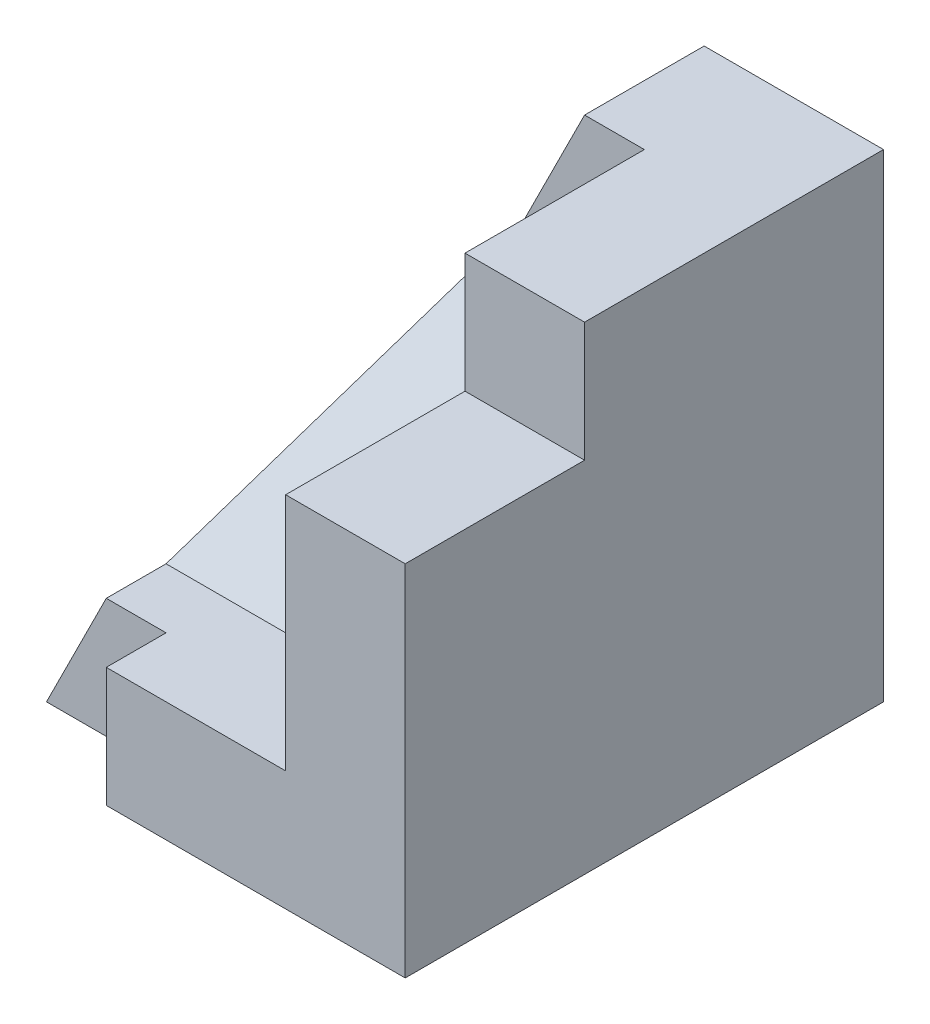
ISO-10303-21;
HEADER;
FILE_DESCRIPTION(('STEP AP214'),'2;1');
FILE_NAME('part.step','',(''),(''),'','','');
FILE_SCHEMA(('AUTOMOTIVE_DESIGN { 1 0 10303 214 1 1 1 1 }'));
ENDSEC;
DATA;
#1=APPLICATION_CONTEXT('core data for automotive mechanical design processes');
#2=APPLICATION_PROTOCOL_DEFINITION('international standard','automotive_design',2000,#1);
#3=PRODUCT_CONTEXT('',#1,'mechanical');
#4=PRODUCT('Part','Part','',(#3));
#5=PRODUCT_RELATED_PRODUCT_CATEGORY('part','',(#4));
#6=PRODUCT_DEFINITION_FORMATION('','',#4);
#7=PRODUCT_DEFINITION_CONTEXT('part definition',#1,'design');
#8=PRODUCT_DEFINITION('design','',#6,#7);
#9=PRODUCT_DEFINITION_SHAPE('','',#8);
#10=(LENGTH_UNIT() NAMED_UNIT(*) SI_UNIT(.MILLI.,.METRE.));
#11=(NAMED_UNIT(*) PLANE_ANGLE_UNIT() SI_UNIT($,.RADIAN.));
#12=(NAMED_UNIT(*) SI_UNIT($,.STERADIAN.) SOLID_ANGLE_UNIT());
#13=UNCERTAINTY_MEASURE_WITH_UNIT(LENGTH_MEASURE(1.E-05),#10,'distance_accuracy_value','');
#14=(GEOMETRIC_REPRESENTATION_CONTEXT(3) GLOBAL_UNCERTAINTY_ASSIGNED_CONTEXT((#13)) GLOBAL_UNIT_ASSIGNED_CONTEXT((#10,
#11,#12)) REPRESENTATION_CONTEXT('',''));
#15=CARTESIAN_POINT('',(0.,0.,0.));
#16=DIRECTION('',(0.,0.,1.));
#17=DIRECTION('',(1.,0.,0.));
#18=AXIS2_PLACEMENT_3D('',#15,#16,#17);
#19=CARTESIAN_POINT('',(17.5,10.,25.));
#20=DIRECTION('',(0.,-1.,0.));
#21=DIRECTION('',(1.,0.,0.));
#22=AXIS2_PLACEMENT_3D('',#19,#20,#21);
#23=PLANE('',#22);
#24=DIRECTION('',(1.,0.,0.));
#25=VECTOR('',#24,1.);
#26=CARTESIAN_POINT('',(17.5,10.,25.));
#27=LINE('',#26,#25);
#28=CARTESIAN_POINT('',(7.5,10.,25.));
#29=VERTEX_POINT('',#28);
#30=CARTESIAN_POINT('',(17.5,10.,25.));
#31=VERTEX_POINT('',#30);
#32=EDGE_CURVE('E197',#29,#31,#27,.T.);
#33=ORIENTED_EDGE('',*,*,#32,.F.);
#34=DIRECTION('',(0.,0.,1.));
#35=VECTOR('',#34,1.);
#36=CARTESIAN_POINT('',(7.5,10.,25.));
#37=LINE('',#36,#35);
#38=CARTESIAN_POINT('',(7.5,10.,40.));
#39=VERTEX_POINT('',#38);
#40=EDGE_CURVE('E200',#29,#39,#37,.T.);
#41=ORIENTED_EDGE('',*,*,#40,.T.);
#42=DIRECTION('',(1.,0.,0.));
#43=VECTOR('',#42,1.);
#44=CARTESIAN_POINT('',(17.5,10.,40.));
#45=LINE('',#44,#43);
#46=CARTESIAN_POINT('',(17.5,10.,40.));
#47=VERTEX_POINT('',#46);
#48=EDGE_CURVE('E190',#39,#47,#45,.T.);
#49=ORIENTED_EDGE('',*,*,#48,.T.);
#50=DIRECTION('',(0.,0.,1.));
#51=VECTOR('',#50,1.);
#52=CARTESIAN_POINT('',(17.5,10.,25.));
#53=LINE('',#52,#51);
#54=EDGE_CURVE('E203',#31,#47,#53,.T.);
#55=ORIENTED_EDGE('',*,*,#54,.F.);
#56=EDGE_LOOP('',(#33,#41,#49,#55));
#57=FACE_BOUND('',#56,.T.);
#58=ADVANCED_FACE('F33',(#57),#23,.F.);
#59=CARTESIAN_POINT('',(-17.5,20.,40.));
#60=DIRECTION('',(0.,-1.,0.));
#61=DIRECTION('',(0.,0.,-1.));
#62=AXIS2_PLACEMENT_3D('',#59,#60,#61);
#63=PLANE('',#62);
#64=DIRECTION('',(-1.,0.,0.));
#65=VECTOR('',#64,1.);
#66=CARTESIAN_POINT('',(7.5,20.,10.));
#67=LINE('',#66,#65);
#68=CARTESIAN_POINT('',(7.5,20.,10.));
#69=VERTEX_POINT('',#68);
#70=CARTESIAN_POINT('',(2.5,20.,10.));
#71=VERTEX_POINT('',#70);
#72=EDGE_CURVE('E48',#69,#71,#67,.T.);
#73=ORIENTED_EDGE('',*,*,#72,.F.);
#74=DIRECTION('',(0.,0.,1.));
#75=VECTOR('',#74,1.);
#76=CARTESIAN_POINT('',(7.5,20.,10.));
#77=LINE('',#76,#75);
#78=CARTESIAN_POINT('',(7.5,20.,25.));
#79=VERTEX_POINT('',#78);
#80=EDGE_CURVE('E141',#69,#79,#77,.T.);
#81=ORIENTED_EDGE('',*,*,#80,.T.);
#82=DIRECTION('',(-1.,0.,0.));
#83=VECTOR('',#82,1.);
#84=CARTESIAN_POINT('',(7.5,20.,25.));
#85=LINE('',#84,#83);
#86=CARTESIAN_POINT('',(17.5,20.,25.));
#87=VERTEX_POINT('',#86);
#88=EDGE_CURVE('E192',#87,#79,#85,.T.);
#89=ORIENTED_EDGE('',*,*,#88,.F.);
#90=DIRECTION('',(0.,0.,-1.));
#91=VECTOR('',#90,1.);
#92=CARTESIAN_POINT('',(17.5,20.,40.));
#93=LINE('',#92,#91);
#94=CARTESIAN_POINT('',(17.5,20.,0.));
#95=VERTEX_POINT('',#94);
#96=EDGE_CURVE('E11',#87,#95,#93,.T.);
#97=ORIENTED_EDGE('',*,*,#96,.T.);
#98=DIRECTION('',(-1.,0.,0.));
#99=VECTOR('',#98,1.);
#100=CARTESIAN_POINT('',(-17.5,20.,0.));
#101=LINE('',#100,#99);
#102=CARTESIAN_POINT('',(2.5,20.,0.));
#103=VERTEX_POINT('',#102);
#104=EDGE_CURVE('E216',#95,#103,#101,.T.);
#105=ORIENTED_EDGE('',*,*,#104,.T.);
#106=DIRECTION('',(0.,0.,1.));
#107=VECTOR('',#106,1.);
#108=CARTESIAN_POINT('',(2.5,20.,0.));
#109=LINE('',#108,#107);
#110=EDGE_CURVE('E164',#103,#71,#109,.T.);
#111=ORIENTED_EDGE('',*,*,#110,.T.);
#112=EDGE_LOOP('',(#73,#81,#89,#97,#105,#111));
#113=FACE_BOUND('',#112,.T.);
#114=ADVANCED_FACE('F245',(#113),#63,.F.);
#115=CARTESIAN_POINT('',(17.5,20.,40.));
#116=DIRECTION('',(-1.,0.,0.));
#117=DIRECTION('',(0.,-1.,0.));
#118=AXIS2_PLACEMENT_3D('',#115,#116,#117);
#119=PLANE('',#118);
#120=DIRECTION('',(0.,1.,0.));
#121=VECTOR('',#120,1.);
#122=CARTESIAN_POINT('',(17.5,20.,25.));
#123=LINE('',#122,#121);
#124=EDGE_CURVE('E77',#31,#87,#123,.T.);
#125=ORIENTED_EDGE('',*,*,#124,.F.);
#126=ORIENTED_EDGE('',*,*,#54,.T.);
#127=DIRECTION('',(0.,1.,0.));
#128=VECTOR('',#127,1.);
#129=CARTESIAN_POINT('',(17.5,20.,40.));
#130=LINE('',#129,#128);
#131=CARTESIAN_POINT('',(17.5,-20.,40.));
#132=VERTEX_POINT('',#131);
#133=EDGE_CURVE('E209',#132,#47,#130,.T.);
#134=ORIENTED_EDGE('',*,*,#133,.F.);
#135=DIRECTION('',(0.,0.,-1.));
#136=VECTOR('',#135,1.);
#137=CARTESIAN_POINT('',(17.5,-20.,40.));
#138=LINE('',#137,#136);
#139=CARTESIAN_POINT('',(17.5,-20.,0.));
#140=VERTEX_POINT('',#139);
#141=EDGE_CURVE('E213',#132,#140,#138,.T.);
#142=ORIENTED_EDGE('',*,*,#141,.T.);
#143=DIRECTION('',(0.,1.,0.));
#144=VECTOR('',#143,1.);
#145=CARTESIAN_POINT('',(17.5,20.,0.));
#146=LINE('',#145,#144);
#147=EDGE_CURVE('E206',#140,#95,#146,.T.);
#148=ORIENTED_EDGE('',*,*,#147,.T.);
#149=ORIENTED_EDGE('',*,*,#96,.F.);
#150=EDGE_LOOP('',(#125,#126,#134,#142,#148,#149));
#151=FACE_BOUND('',#150,.T.);
#152=ADVANCED_FACE('F35',(#151),#119,.F.);
#153=CARTESIAN_POINT('',(-17.5,-20.,40.));
#154=DIRECTION('',(0.,1.,0.));
#155=DIRECTION('',(0.,0.,1.));
#156=AXIS2_PLACEMENT_3D('',#153,#154,#155);
#157=PLANE('',#156);
#158=DIRECTION('',(1.,0.,0.));
#159=VECTOR('',#158,1.);
#160=CARTESIAN_POINT('',(-17.5,-20.,40.));
#161=LINE('',#160,#159);
#162=CARTESIAN_POINT('',(-7.5,-20.,40.));
#163=VERTEX_POINT('',#162);
#164=EDGE_CURVE('E57',#163,#132,#161,.T.);
#165=ORIENTED_EDGE('',*,*,#164,.F.);
#166=DIRECTION('',(0.,0.,1.));
#167=VECTOR('',#166,1.);
#168=CARTESIAN_POINT('',(-7.5,-20.,35.));
#169=LINE('',#168,#167);
#170=CARTESIAN_POINT('',(-7.5,-20.,35.));
#171=VERTEX_POINT('',#170);
#172=EDGE_CURVE('E188',#171,#163,#169,.T.);
#173=ORIENTED_EDGE('',*,*,#172,.F.);
#174=DIRECTION('',(1.,0.,0.));
#175=VECTOR('',#174,1.);
#176=CARTESIAN_POINT('',(-7.5,-20.,35.));
#177=LINE('',#176,#175);
#178=CARTESIAN_POINT('',(-17.5,-20.,35.));
#179=VERTEX_POINT('',#178);
#180=EDGE_CURVE('E182',#179,#171,#177,.T.);
#181=ORIENTED_EDGE('',*,*,#180,.F.);
#182=DIRECTION('',(0.,0.,-1.));
#183=VECTOR('',#182,1.);
#184=CARTESIAN_POINT('',(-17.5,-20.,40.));
#185=LINE('',#184,#183);
#186=CARTESIAN_POINT('',(-17.5,-20.,0.));
#187=VERTEX_POINT('',#186);
#188=EDGE_CURVE('E41',#179,#187,#185,.T.);
#189=ORIENTED_EDGE('',*,*,#188,.T.);
#190=DIRECTION('',(1.,0.,0.));
#191=VECTOR('',#190,1.);
#192=CARTESIAN_POINT('',(-17.5,-20.,0.));
#193=LINE('',#192,#191);
#194=EDGE_CURVE('E211',#187,#140,#193,.T.);
#195=ORIENTED_EDGE('',*,*,#194,.T.);
#196=ORIENTED_EDGE('',*,*,#141,.F.);
#197=EDGE_LOOP('',(#165,#173,#181,#189,#195,#196));
#198=FACE_BOUND('',#197,.T.);
#199=ADVANCED_FACE('F223',(#198),#157,.F.);
#200=CARTESIAN_POINT('',(0.,0.,40.));
#201=DIRECTION('',(0.,0.,1.));
#202=DIRECTION('',(1.,0.,0.));
#203=AXIS2_PLACEMENT_3D('',#200,#201,#202);
#204=PLANE('',#203);
#205=DIRECTION('',(0.,1.,0.));
#206=VECTOR('',#205,1.);
#207=CARTESIAN_POINT('',(7.5,-9.99999999999999,40.));
#208=LINE('',#207,#206);
#209=CARTESIAN_POINT('',(7.5,-9.99999999999999,40.));
#210=VERTEX_POINT('',#209);
#211=EDGE_CURVE('E170',#210,#39,#208,.T.);
#212=ORIENTED_EDGE('',*,*,#211,.F.);
#213=DIRECTION('',(1.,0.,0.));
#214=VECTOR('',#213,1.);
#215=CARTESIAN_POINT('',(-17.5,-9.99999999999999,40.));
#216=LINE('',#215,#214);
#217=CARTESIAN_POINT('',(-7.50000000000001,-9.99999999999999,40.));
#218=VERTEX_POINT('',#217);
#219=EDGE_CURVE('E166',#218,#210,#216,.T.);
#220=ORIENTED_EDGE('',*,*,#219,.F.);
#221=DIRECTION('',(0.,1.,0.));
#222=VECTOR('',#221,1.);
#223=CARTESIAN_POINT('',(-7.50000000000001,-9.99999999999999,40.));
#224=LINE('',#223,#222);
#225=EDGE_CURVE('E175',#163,#218,#224,.T.);
#226=ORIENTED_EDGE('',*,*,#225,.F.);
#227=ORIENTED_EDGE('',*,*,#164,.T.);
#228=ORIENTED_EDGE('',*,*,#133,.T.);
#229=ORIENTED_EDGE('',*,*,#48,.F.);
#230=EDGE_LOOP('',(#212,#220,#226,#227,#228,#229));
#231=FACE_BOUND('',#230,.T.);
#232=ADVANCED_FACE('F237',(#231),#204,.T.);
#233=CARTESIAN_POINT('',(0.,0.,0.));
#234=DIRECTION('',(0.,0.,1.));
#235=DIRECTION('',(1.,0.,0.));
#236=AXIS2_PLACEMENT_3D('',#233,#234,#235);
#237=PLANE('',#236);
#238=ORIENTED_EDGE('',*,*,#194,.F.);
#239=DIRECTION('',(0.447213595499958,0.894427190999916,0.));
#240=VECTOR('',#239,1.);
#241=CARTESIAN_POINT('',(2.5,20.,0.));
#242=LINE('',#241,#240);
#243=EDGE_CURVE('E161',#187,#103,#242,.T.);
#244=ORIENTED_EDGE('',*,*,#243,.T.);
#245=ORIENTED_EDGE('',*,*,#104,.F.);
#246=ORIENTED_EDGE('',*,*,#147,.F.);
#247=EDGE_LOOP('',(#238,#244,#245,#246));
#248=FACE_BOUND('',#247,.T.);
#249=ADVANCED_FACE('F229',(#248),#237,.F.);
#250=CARTESIAN_POINT('',(0.,0.,25.));
#251=DIRECTION('',(0.,0.,-1.));
#252=DIRECTION('',(-1.,0.,0.));
#253=AXIS2_PLACEMENT_3D('',#250,#251,#252);
#254=PLANE('',#253);
#255=ORIENTED_EDGE('',*,*,#88,.T.);
#256=DIRECTION('',(0.,-1.,0.));
#257=VECTOR('',#256,1.);
#258=CARTESIAN_POINT('',(7.5,10.,25.));
#259=LINE('',#258,#257);
#260=EDGE_CURVE('E194',#79,#29,#259,.T.);
#261=ORIENTED_EDGE('',*,*,#260,.T.);
#262=ORIENTED_EDGE('',*,*,#32,.T.);
#263=ORIENTED_EDGE('',*,*,#124,.T.);
#264=EDGE_LOOP('',(#255,#261,#262,#263));
#265=FACE_BOUND('',#264,.T.);
#266=ADVANCED_FACE('F248',(#265),#254,.F.);
#267=CARTESIAN_POINT('',(-7.50000000000001,-9.99999999999999,35.));
#268=DIRECTION('',(1.,0.,0.));
#269=DIRECTION('',(0.,1.,0.));
#270=AXIS2_PLACEMENT_3D('',#267,#268,#269);
#271=PLANE('',#270);
#272=ORIENTED_EDGE('',*,*,#225,.T.);
#273=DIRECTION('',(0.,0.,1.));
#274=VECTOR('',#273,1.);
#275=CARTESIAN_POINT('',(-7.50000000000001,-9.99999999999999,35.));
#276=LINE('',#275,#274);
#277=CARTESIAN_POINT('',(-7.5,-9.99999999999999,35.));
#278=VERTEX_POINT('',#277);
#279=EDGE_CURVE('E185',#278,#218,#276,.T.);
#280=ORIENTED_EDGE('',*,*,#279,.F.);
#281=DIRECTION('',(0.,1.,0.));
#282=VECTOR('',#281,1.);
#283=CARTESIAN_POINT('',(-7.50000000000001,-9.99999999999999,35.));
#284=LINE('',#283,#282);
#285=EDGE_CURVE('E176',#171,#278,#284,.T.);
#286=ORIENTED_EDGE('',*,*,#285,.F.);
#287=ORIENTED_EDGE('',*,*,#172,.T.);
#288=EDGE_LOOP('',(#272,#280,#286,#287));
#289=FACE_BOUND('',#288,.T.);
#290=ADVANCED_FACE('F233',(#289),#271,.F.);
#291=CARTESIAN_POINT('',(0.,0.,35.));
#292=DIRECTION('',(0.,0.,-1.));
#293=DIRECTION('',(-1.,0.,0.));
#294=AXIS2_PLACEMENT_3D('',#291,#292,#293);
#295=PLANE('',#294);
#296=DIRECTION('',(-1.,0.,0.));
#297=VECTOR('',#296,1.);
#298=CARTESIAN_POINT('',(-17.5,-9.99999999999999,35.));
#299=LINE('',#298,#297);
#300=CARTESIAN_POINT('',(-12.5,-9.99999999999999,35.));
#301=VERTEX_POINT('',#300);
#302=EDGE_CURVE('E179',#278,#301,#299,.T.);
#303=ORIENTED_EDGE('',*,*,#302,.T.);
#304=DIRECTION('',(0.447213595499958,0.894427190999916,0.));
#305=VECTOR('',#304,1.);
#306=CARTESIAN_POINT('',(-12.5,-9.99999999999999,35.));
#307=LINE('',#306,#305);
#308=EDGE_CURVE('E158',#179,#301,#307,.T.);
#309=ORIENTED_EDGE('',*,*,#308,.F.);
#310=ORIENTED_EDGE('',*,*,#180,.T.);
#311=ORIENTED_EDGE('',*,*,#285,.T.);
#312=EDGE_LOOP('',(#303,#309,#310,#311));
#313=FACE_BOUND('',#312,.T.);
#314=ADVANCED_FACE('F255',(#313),#295,.F.);
#315=CARTESIAN_POINT('',(7.5,-9.99999999999999,30.));
#316=DIRECTION('',(1.,0.,0.));
#317=DIRECTION('',(0.,1.,0.));
#318=AXIS2_PLACEMENT_3D('',#315,#316,#317);
#319=PLANE('',#318);
#320=ORIENTED_EDGE('',*,*,#40,.F.);
#321=ORIENTED_EDGE('',*,*,#260,.F.);
#322=ORIENTED_EDGE('',*,*,#80,.F.);
#323=DIRECTION('',(0.,1.,0.));
#324=VECTOR('',#323,1.);
#325=CARTESIAN_POINT('',(7.5,10.,10.));
#326=LINE('',#325,#324);
#327=CARTESIAN_POINT('',(7.5,10.,10.));
#328=VERTEX_POINT('',#327);
#329=EDGE_CURVE('E153',#328,#69,#326,.T.);
#330=ORIENTED_EDGE('',*,*,#329,.F.);
#331=DIRECTION('',(0.,0.707106781186547,-0.707106781186548));
#332=VECTOR('',#331,1.);
#333=CARTESIAN_POINT('',(7.5,10.,10.));
#334=LINE('',#333,#332);
#335=CARTESIAN_POINT('',(7.5,-9.99999999999999,30.));
#336=VERTEX_POINT('',#335);
#337=EDGE_CURVE('E139',#336,#328,#334,.T.);
#338=ORIENTED_EDGE('',*,*,#337,.F.);
#339=DIRECTION('',(0.,0.,1.));
#340=VECTOR('',#339,1.);
#341=CARTESIAN_POINT('',(7.5,-9.99999999999999,30.));
#342=LINE('',#341,#340);
#343=EDGE_CURVE('E169',#336,#210,#342,.T.);
#344=ORIENTED_EDGE('',*,*,#343,.T.);
#345=ORIENTED_EDGE('',*,*,#211,.T.);
#346=EDGE_LOOP('',(#320,#321,#322,#330,#338,#344,#345));
#347=FACE_BOUND('',#346,.T.);
#348=ADVANCED_FACE('F243',(#347),#319,.F.);
#349=CARTESIAN_POINT('',(-17.5,-9.99999999999999,30.));
#350=DIRECTION('',(0.,-1.,0.));
#351=DIRECTION('',(0.,0.,-1.));
#352=AXIS2_PLACEMENT_3D('',#349,#350,#351);
#353=PLANE('',#352);
#354=DIRECTION('',(1.,0.,0.));
#355=VECTOR('',#354,1.);
#356=CARTESIAN_POINT('',(-17.5,-9.99999999999999,30.));
#357=LINE('',#356,#355);
#358=CARTESIAN_POINT('',(-12.5,-9.99999999999999,30.));
#359=VERTEX_POINT('',#358);
#360=EDGE_CURVE('E167',#359,#336,#357,.T.);
#361=ORIENTED_EDGE('',*,*,#360,.F.);
#362=DIRECTION('',(0.,0.,1.));
#363=VECTOR('',#362,1.);
#364=CARTESIAN_POINT('',(-12.5,-9.99999999999999,25.));
#365=LINE('',#364,#363);
#366=EDGE_CURVE('E148',#359,#301,#365,.T.);
#367=ORIENTED_EDGE('',*,*,#366,.T.);
#368=ORIENTED_EDGE('',*,*,#302,.F.);
#369=ORIENTED_EDGE('',*,*,#279,.T.);
#370=ORIENTED_EDGE('',*,*,#219,.T.);
#371=ORIENTED_EDGE('',*,*,#343,.F.);
#372=EDGE_LOOP('',(#361,#367,#368,#369,#370,#371));
#373=FACE_BOUND('',#372,.T.);
#374=ADVANCED_FACE('F241',(#373),#353,.F.);
#375=CARTESIAN_POINT('',(2.5,20.,0.));
#376=DIRECTION('',(0.894427190999916,-0.447213595499958,0.));
#377=DIRECTION('',(0.447213595499958,0.894427190999916,0.));
#378=AXIS2_PLACEMENT_3D('',#375,#376,#377);
#379=PLANE('',#378);
#380=ORIENTED_EDGE('',*,*,#366,.F.);
#381=DIRECTION('',(-0.333333333333333,-0.666666666666667,0.666666666666667));
#382=VECTOR('',#381,1.);
#383=CARTESIAN_POINT('',(-12.5,-9.99999999999999,30.));
#384=LINE('',#383,#382);
#385=CARTESIAN_POINT('',(-2.49999999999999,10.,10.));
#386=VERTEX_POINT('',#385);
#387=EDGE_CURVE('E136',#386,#359,#384,.T.);
#388=ORIENTED_EDGE('',*,*,#387,.F.);
#389=DIRECTION('',(-0.447213595499958,-0.894427190999916,0.));
#390=VECTOR('',#389,1.);
#391=CARTESIAN_POINT('',(2.5,20.,10.));
#392=LINE('',#391,#390);
#393=EDGE_CURVE('E142',#71,#386,#392,.T.);
#394=ORIENTED_EDGE('',*,*,#393,.F.);
#395=ORIENTED_EDGE('',*,*,#110,.F.);
#396=ORIENTED_EDGE('',*,*,#243,.F.);
#397=ORIENTED_EDGE('',*,*,#188,.F.);
#398=ORIENTED_EDGE('',*,*,#308,.T.);
#399=EDGE_LOOP('',(#380,#388,#394,#395,#396,#397,#398));
#400=FACE_BOUND('',#399,.T.);
#401=ADVANCED_FACE('F145',(#400),#379,.F.);
#402=CARTESIAN_POINT('',(0.,0.,10.));
#403=DIRECTION('',(0.,0.,1.));
#404=DIRECTION('',(1.,0.,0.));
#405=AXIS2_PLACEMENT_3D('',#402,#403,#404);
#406=PLANE('',#405);
#407=ORIENTED_EDGE('',*,*,#329,.T.);
#408=ORIENTED_EDGE('',*,*,#72,.T.);
#409=ORIENTED_EDGE('',*,*,#393,.T.);
#410=DIRECTION('',(1.,0.,0.));
#411=VECTOR('',#410,1.);
#412=CARTESIAN_POINT('',(-2.49999999999999,10.,10.));
#413=LINE('',#412,#411);
#414=EDGE_CURVE('E133',#386,#328,#413,.T.);
#415=ORIENTED_EDGE('',*,*,#414,.T.);
#416=EDGE_LOOP('',(#407,#408,#409,#415));
#417=FACE_BOUND('',#416,.T.);
#418=ADVANCED_FACE('F151',(#417),#406,.T.);
#419=CARTESIAN_POINT('',(0.,10.,10.));
#420=DIRECTION('',(0.,-0.707106781186548,-0.707106781186547));
#421=DIRECTION('',(0.,0.707106781186547,-0.707106781186548));
#422=AXIS2_PLACEMENT_3D('',#419,#420,#421);
#423=PLANE('',#422);
#424=ORIENTED_EDGE('',*,*,#414,.F.);
#425=ORIENTED_EDGE('',*,*,#387,.T.);
#426=ORIENTED_EDGE('',*,*,#360,.T.);
#427=ORIENTED_EDGE('',*,*,#337,.T.);
#428=EDGE_LOOP('',(#424,#425,#426,#427));
#429=FACE_BOUND('',#428,.T.);
#430=ADVANCED_FACE('F135',(#429),#423,.F.);
#431=CLOSED_SHELL('',(#58,#114,#152,#199,#232,#249,#266,#290,#314,#348,#374,#401,#418,#430));
#432=MANIFOLD_SOLID_BREP('B2',#431);
#433=ADVANCED_BREP_SHAPE_REPRESENTATION('',(#18,#432),#14);
#434=SHAPE_DEFINITION_REPRESENTATION(#9,#433);
ENDSEC;
END-ISO-10303-21;
